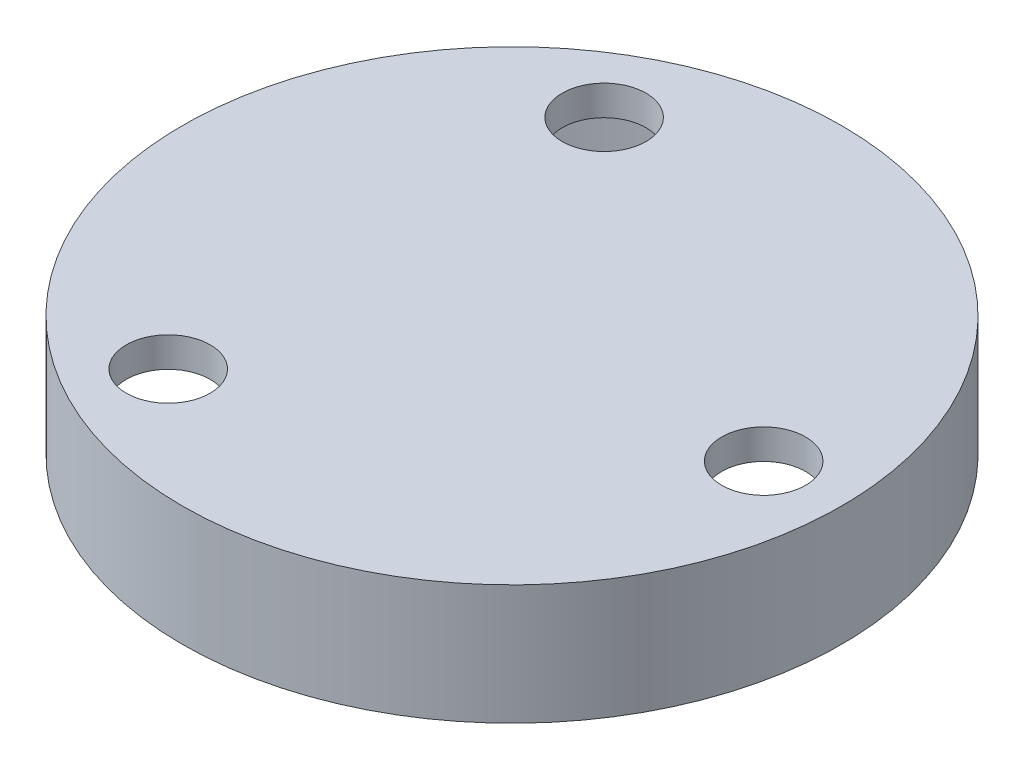
ISO-10303-21;
HEADER;
FILE_DESCRIPTION(('STEP AP214'),'2;1');
FILE_NAME('part.step','',(''),(''),'','','');
FILE_SCHEMA(('AUTOMOTIVE_DESIGN { 1 0 10303 214 1 1 1 1 }'));
ENDSEC;
DATA;
#1=APPLICATION_CONTEXT('core data for automotive mechanical design processes');
#2=APPLICATION_PROTOCOL_DEFINITION('international standard','automotive_design',2000,#1);
#3=PRODUCT_CONTEXT('',#1,'mechanical');
#4=PRODUCT('Part','Part','',(#3));
#5=PRODUCT_RELATED_PRODUCT_CATEGORY('part','',(#4));
#6=PRODUCT_DEFINITION_FORMATION('','',#4);
#7=PRODUCT_DEFINITION_CONTEXT('part definition',#1,'design');
#8=PRODUCT_DEFINITION('design','',#6,#7);
#9=PRODUCT_DEFINITION_SHAPE('','',#8);
#10=(LENGTH_UNIT() NAMED_UNIT(*) SI_UNIT(.MILLI.,.METRE.));
#11=(NAMED_UNIT(*) PLANE_ANGLE_UNIT() SI_UNIT($,.RADIAN.));
#12=(NAMED_UNIT(*) SI_UNIT($,.STERADIAN.) SOLID_ANGLE_UNIT());
#13=UNCERTAINTY_MEASURE_WITH_UNIT(LENGTH_MEASURE(1.E-05),#10,'distance_accuracy_value','');
#14=(GEOMETRIC_REPRESENTATION_CONTEXT(3) GLOBAL_UNCERTAINTY_ASSIGNED_CONTEXT((#13)) GLOBAL_UNIT_ASSIGNED_CONTEXT((#10,
#11,#12)) REPRESENTATION_CONTEXT('',''));
#15=CARTESIAN_POINT('',(0.,0.,0.));
#16=DIRECTION('',(0.,0.,1.));
#17=DIRECTION('',(1.,0.,0.));
#18=AXIS2_PLACEMENT_3D('',#15,#16,#17);
#19=CARTESIAN_POINT('',(0.,-20.,0.));
#20=DIRECTION('',(0.,1.,0.));
#21=DIRECTION('',(0.,0.,1.));
#22=AXIS2_PLACEMENT_3D('',#19,#20,#21);
#23=CYLINDRICAL_SURFACE('',#22,50.);
#24=CARTESIAN_POINT('',(0.,-20.,0.));
#25=DIRECTION('',(0.,1.,0.));
#26=DIRECTION('',(0.,0.,1.));
#27=AXIS2_PLACEMENT_3D('',#24,#25,#26);
#28=CIRCLE('',#27,50.);
#29=CARTESIAN_POINT('',(0.,-20.,50.));
#30=VERTEX_POINT('',#29);
#31=EDGE_CURVE('E85',#30,#30,#28,.T.);
#32=ORIENTED_EDGE('',*,*,#31,.F.);
#33=EDGE_LOOP('',(#32));
#34=FACE_BOUND('',#33,.T.);
#35=CARTESIAN_POINT('',(0.,-5.,0.));
#36=DIRECTION('',(0.,1.,0.));
#37=DIRECTION('',(0.,0.,1.));
#38=AXIS2_PLACEMENT_3D('',#35,#36,#37);
#39=CIRCLE('',#38,50.);
#40=CARTESIAN_POINT('',(0.,-5.,50.));
#41=VERTEX_POINT('',#40);
#42=EDGE_CURVE('E10',#41,#41,#39,.F.);
#43=ORIENTED_EDGE('',*,*,#42,.F.);
#44=EDGE_LOOP('',(#43));
#45=FACE_BOUND('',#44,.T.);
#46=ADVANCED_FACE('F43',(#34,#45),#23,.F.);
#47=CARTESIAN_POINT('',(0.,-20.,0.));
#48=DIRECTION('',(0.,1.,0.));
#49=DIRECTION('',(0.,0.,1.));
#50=AXIS2_PLACEMENT_3D('',#47,#48,#49);
#51=CYLINDRICAL_SURFACE('',#50,55.);
#52=CARTESIAN_POINT('',(0.,0.,0.));
#53=DIRECTION('',(0.,1.,0.));
#54=DIRECTION('',(0.,0.,1.));
#55=AXIS2_PLACEMENT_3D('',#52,#53,#54);
#56=CIRCLE('',#55,55.);
#57=CARTESIAN_POINT('',(0.,0.,55.));
#58=VERTEX_POINT('',#57);
#59=EDGE_CURVE('E58',#58,#58,#56,.T.);
#60=ORIENTED_EDGE('',*,*,#59,.F.);
#61=EDGE_LOOP('',(#60));
#62=FACE_BOUND('',#61,.T.);
#63=CARTESIAN_POINT('',(0.,-20.,0.));
#64=DIRECTION('',(0.,1.,0.));
#65=DIRECTION('',(0.,0.,1.));
#66=AXIS2_PLACEMENT_3D('',#63,#64,#65);
#67=CIRCLE('',#66,55.);
#68=CARTESIAN_POINT('',(0.,-20.,55.));
#69=VERTEX_POINT('',#68);
#70=EDGE_CURVE('E52',#69,#69,#67,.T.);
#71=ORIENTED_EDGE('',*,*,#70,.T.);
#72=EDGE_LOOP('',(#71));
#73=FACE_BOUND('',#72,.T.);
#74=ADVANCED_FACE('F45',(#62,#73),#51,.T.);
#75=CARTESIAN_POINT('',(0.,-20.,0.));
#76=DIRECTION('',(0.,1.,0.));
#77=DIRECTION('',(0.,0.,1.));
#78=AXIS2_PLACEMENT_3D('',#75,#76,#77);
#79=PLANE('',#78);
#80=ORIENTED_EDGE('',*,*,#31,.T.);
#81=EDGE_LOOP('',(#80));
#82=FACE_BOUND('',#81,.T.);
#83=ORIENTED_EDGE('',*,*,#70,.F.);
#84=EDGE_LOOP('',(#83));
#85=FACE_BOUND('',#84,.T.);
#86=ADVANCED_FACE('F98',(#82,#85),#79,.F.);
#87=CARTESIAN_POINT('',(0.,0.,0.));
#88=DIRECTION('',(0.,1.,0.));
#89=DIRECTION('',(0.,0.,1.));
#90=AXIS2_PLACEMENT_3D('',#87,#88,#89);
#91=PLANE('',#90);
#92=CARTESIAN_POINT('',(-20.9999999999997,0.,36.3730669589466));
#93=DIRECTION('',(0.,1.,0.));
#94=DIRECTION('',(0.,0.,1.));
#95=AXIS2_PLACEMENT_3D('',#92,#93,#94);
#96=CIRCLE('',#95,7.);
#97=CARTESIAN_POINT('',(-20.9999999999997,0.,43.3730669589466));
#98=VERTEX_POINT('',#97);
#99=EDGE_CURVE('E79',#98,#98,#96,.T.);
#100=ORIENTED_EDGE('',*,*,#99,.F.);
#101=EDGE_LOOP('',(#100));
#102=FACE_BOUND('',#101,.T.);
#103=CARTESIAN_POINT('',(-21.0000000000002,0.,-36.3730669589463));
#104=DIRECTION('',(0.,1.,0.));
#105=DIRECTION('',(0.,0.,1.));
#106=AXIS2_PLACEMENT_3D('',#103,#104,#105);
#107=CIRCLE('',#106,7.);
#108=CARTESIAN_POINT('',(-21.0000000000002,0.,-29.3730669589463));
#109=VERTEX_POINT('',#108);
#110=EDGE_CURVE('E65',#109,#109,#107,.T.);
#111=ORIENTED_EDGE('',*,*,#110,.F.);
#112=EDGE_LOOP('',(#111));
#113=FACE_BOUND('',#112,.T.);
#114=CARTESIAN_POINT('',(42.,0.,0.));
#115=DIRECTION('',(0.,1.,0.));
#116=DIRECTION('',(0.,0.,1.));
#117=AXIS2_PLACEMENT_3D('',#114,#115,#116);
#118=CIRCLE('',#117,7.);
#119=CARTESIAN_POINT('',(42.,0.,7.));
#120=VERTEX_POINT('',#119);
#121=EDGE_CURVE('E64',#120,#120,#118,.T.);
#122=ORIENTED_EDGE('',*,*,#121,.F.);
#123=EDGE_LOOP('',(#122));
#124=FACE_BOUND('',#123,.T.);
#125=ORIENTED_EDGE('',*,*,#59,.T.);
#126=EDGE_LOOP('',(#125));
#127=FACE_BOUND('',#126,.T.);
#128=ADVANCED_FACE('F94',(#102,#113,#124,#127),#91,.T.);
#129=CARTESIAN_POINT('',(0.,-5.,0.));
#130=DIRECTION('',(0.,1.,0.));
#131=DIRECTION('',(0.,0.,1.));
#132=AXIS2_PLACEMENT_3D('',#129,#130,#131);
#133=PLANE('',#132);
#134=CARTESIAN_POINT('',(-20.9999999999997,-5.,36.3730669589466));
#135=DIRECTION('',(0.,1.,0.));
#136=DIRECTION('',(0.,0.,1.));
#137=AXIS2_PLACEMENT_3D('',#134,#135,#136);
#138=CIRCLE('',#137,7.);
#139=CARTESIAN_POINT('',(-20.9999999999997,-5.,43.3730669589466));
#140=VERTEX_POINT('',#139);
#141=EDGE_CURVE('E47',#140,#140,#138,.T.);
#142=ORIENTED_EDGE('',*,*,#141,.T.);
#143=EDGE_LOOP('',(#142));
#144=FACE_BOUND('',#143,.T.);
#145=CARTESIAN_POINT('',(-21.0000000000002,-5.,-36.3730669589463));
#146=DIRECTION('',(0.,1.,0.));
#147=DIRECTION('',(0.,0.,1.));
#148=AXIS2_PLACEMENT_3D('',#145,#146,#147);
#149=CIRCLE('',#148,7.);
#150=CARTESIAN_POINT('',(-21.0000000000002,-5.,-29.3730669589463));
#151=VERTEX_POINT('',#150);
#152=EDGE_CURVE('E61',#151,#151,#149,.T.);
#153=ORIENTED_EDGE('',*,*,#152,.T.);
#154=EDGE_LOOP('',(#153));
#155=FACE_BOUND('',#154,.T.);
#156=CARTESIAN_POINT('',(42.,-5.,0.));
#157=DIRECTION('',(0.,1.,0.));
#158=DIRECTION('',(0.,0.,1.));
#159=AXIS2_PLACEMENT_3D('',#156,#157,#158);
#160=CIRCLE('',#159,7.);
#161=CARTESIAN_POINT('',(42.,-5.,7.));
#162=VERTEX_POINT('',#161);
#163=EDGE_CURVE('E71',#162,#162,#160,.T.);
#164=ORIENTED_EDGE('',*,*,#163,.T.);
#165=EDGE_LOOP('',(#164));
#166=FACE_BOUND('',#165,.T.);
#167=ORIENTED_EDGE('',*,*,#42,.T.);
#168=EDGE_LOOP('',(#167));
#169=FACE_BOUND('',#168,.T.);
#170=ADVANCED_FACE('F107',(#144,#155,#166,#169),#133,.F.);
#171=CARTESIAN_POINT('',(42.,0.,0.));
#172=DIRECTION('',(0.,1.,0.));
#173=DIRECTION('',(0.,0.,1.));
#174=AXIS2_PLACEMENT_3D('',#171,#172,#173);
#175=CYLINDRICAL_SURFACE('',#174,7.);
#176=ORIENTED_EDGE('',*,*,#121,.T.);
#177=EDGE_LOOP('',(#176));
#178=FACE_BOUND('',#177,.T.);
#179=ORIENTED_EDGE('',*,*,#163,.F.);
#180=EDGE_LOOP('',(#179));
#181=FACE_BOUND('',#180,.T.);
#182=ADVANCED_FACE('F117',(#178,#181),#175,.F.);
#183=CARTESIAN_POINT('',(-21.0000000000002,0.,-36.3730669589463));
#184=DIRECTION('',(0.,1.,0.));
#185=DIRECTION('',(0.,0.,1.));
#186=AXIS2_PLACEMENT_3D('',#183,#184,#185);
#187=CYLINDRICAL_SURFACE('',#186,7.);
#188=ORIENTED_EDGE('',*,*,#110,.T.);
#189=EDGE_LOOP('',(#188));
#190=FACE_BOUND('',#189,.T.);
#191=ORIENTED_EDGE('',*,*,#152,.F.);
#192=EDGE_LOOP('',(#191));
#193=FACE_BOUND('',#192,.T.);
#194=ADVANCED_FACE('F121',(#190,#193),#187,.F.);
#195=CARTESIAN_POINT('',(-20.9999999999997,0.,36.3730669589466));
#196=DIRECTION('',(0.,1.,0.));
#197=DIRECTION('',(0.,0.,1.));
#198=AXIS2_PLACEMENT_3D('',#195,#196,#197);
#199=CYLINDRICAL_SURFACE('',#198,7.);
#200=ORIENTED_EDGE('',*,*,#99,.T.);
#201=EDGE_LOOP('',(#200));
#202=FACE_BOUND('',#201,.T.);
#203=ORIENTED_EDGE('',*,*,#141,.F.);
#204=EDGE_LOOP('',(#203));
#205=FACE_BOUND('',#204,.T.);
#206=ADVANCED_FACE('F125',(#202,#205),#199,.F.);
#207=CLOSED_SHELL('',(#46,#74,#86,#128,#170,#182,#194,#206));
#208=MANIFOLD_SOLID_BREP('B2',#207);
#209=ADVANCED_BREP_SHAPE_REPRESENTATION('',(#18,#208),#14);
#210=SHAPE_DEFINITION_REPRESENTATION(#9,#209);
ENDSEC;
END-ISO-10303-21;
